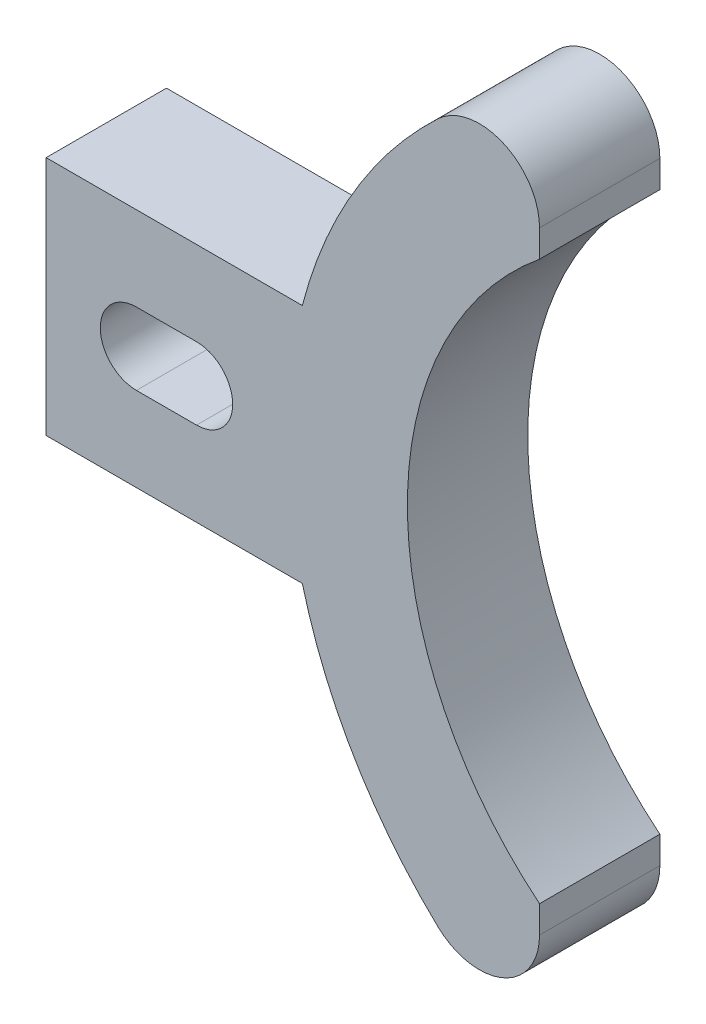
ISO-10303-21;
HEADER;
FILE_DESCRIPTION(('STEP AP214'),'2;1');
FILE_NAME('part.step','',(''),(''),'','','');
FILE_SCHEMA(('AUTOMOTIVE_DESIGN { 1 0 10303 214 1 1 1 1 }'));
ENDSEC;
DATA;
#1=APPLICATION_CONTEXT('core data for automotive mechanical design processes');
#2=APPLICATION_PROTOCOL_DEFINITION('international standard','automotive_design',2000,#1);
#3=PRODUCT_CONTEXT('',#1,'mechanical');
#4=PRODUCT('Part','Part','',(#3));
#5=PRODUCT_RELATED_PRODUCT_CATEGORY('part','',(#4));
#6=PRODUCT_DEFINITION_FORMATION('','',#4);
#7=PRODUCT_DEFINITION_CONTEXT('part definition',#1,'design');
#8=PRODUCT_DEFINITION('design','',#6,#7);
#9=PRODUCT_DEFINITION_SHAPE('','',#8);
#10=(LENGTH_UNIT() NAMED_UNIT(*) SI_UNIT(.MILLI.,.METRE.));
#11=(NAMED_UNIT(*) PLANE_ANGLE_UNIT() SI_UNIT($,.RADIAN.));
#12=(NAMED_UNIT(*) SI_UNIT($,.STERADIAN.) SOLID_ANGLE_UNIT());
#13=UNCERTAINTY_MEASURE_WITH_UNIT(LENGTH_MEASURE(1.E-05),#10,'distance_accuracy_value','');
#14=(GEOMETRIC_REPRESENTATION_CONTEXT(3) GLOBAL_UNCERTAINTY_ASSIGNED_CONTEXT((#13)) GLOBAL_UNIT_ASSIGNED_CONTEXT((#10,
#11,#12)) REPRESENTATION_CONTEXT('',''));
#15=CARTESIAN_POINT('',(0.,0.,0.));
#16=DIRECTION('',(0.,0.,1.));
#17=DIRECTION('',(1.,0.,0.));
#18=AXIS2_PLACEMENT_3D('',#15,#16,#17);
#19=CARTESIAN_POINT('',(0.,0.,12.7));
#20=DIRECTION('',(0.,1.,0.));
#21=DIRECTION('',(0.,0.,1.));
#22=AXIS2_PLACEMENT_3D('',#19,#20,#21);
#23=PLANE('',#22);
#24=DIRECTION('',(1.,0.,0.));
#25=VECTOR('',#24,1.);
#26=CARTESIAN_POINT('',(0.,0.,0.));
#27=LINE('',#26,#25);
#28=CARTESIAN_POINT('',(0.,0.,0.));
#29=VERTEX_POINT('',#28);
#30=CARTESIAN_POINT('',(27.0389318159176,0.,0.));
#31=VERTEX_POINT('',#30);
#32=EDGE_CURVE('E225',#29,#31,#27,.T.);
#33=ORIENTED_EDGE('',*,*,#32,.T.);
#34=DIRECTION('',(0.,0.,-1.));
#35=VECTOR('',#34,1.);
#36=CARTESIAN_POINT('',(27.0389318159176,0.,12.7));
#37=LINE('',#36,#35);
#38=CARTESIAN_POINT('',(27.0389318159176,0.,12.7));
#39=VERTEX_POINT('',#38);
#40=EDGE_CURVE('E256',#39,#31,#37,.T.);
#41=ORIENTED_EDGE('',*,*,#40,.F.);
#42=DIRECTION('',(1.,0.,0.));
#43=VECTOR('',#42,1.);
#44=CARTESIAN_POINT('',(0.,0.,12.7));
#45=LINE('',#44,#43);
#46=CARTESIAN_POINT('',(0.,0.,12.7));
#47=VERTEX_POINT('',#46);
#48=EDGE_CURVE('E201',#47,#39,#45,.T.);
#49=ORIENTED_EDGE('',*,*,#48,.F.);
#50=DIRECTION('',(0.,0.,-1.));
#51=VECTOR('',#50,1.);
#52=CARTESIAN_POINT('',(0.,0.,12.7));
#53=LINE('',#52,#51);
#54=EDGE_CURVE('E224',#47,#29,#53,.T.);
#55=ORIENTED_EDGE('',*,*,#54,.T.);
#56=EDGE_LOOP('',(#33,#41,#49,#55));
#57=FACE_BOUND('',#56,.T.);
#58=ADVANCED_FACE('F40',(#57),#23,.F.);
#59=CARTESIAN_POINT('',(76.2,12.7,12.7));
#60=DIRECTION('',(0.,0.,-1.));
#61=DIRECTION('',(-1.,0.,0.));
#62=AXIS2_PLACEMENT_3D('',#59,#60,#61);
#63=CYLINDRICAL_SURFACE('',#62,50.775);
#64=CARTESIAN_POINT('',(76.2,12.7,0.));
#65=DIRECTION('',(0.,0.,1.));
#66=DIRECTION('',(1.,0.,0.));
#67=AXIS2_PLACEMENT_3D('',#64,#65,#66);
#68=CIRCLE('',#67,50.775);
#69=CARTESIAN_POINT('',(41.3632639279685,-24.2391722274284,0.));
#70=VERTEX_POINT('',#69);
#71=EDGE_CURVE('E229',#31,#70,#68,.T.);
#72=ORIENTED_EDGE('',*,*,#71,.T.);
#73=DIRECTION('',(0.,0.,-1.));
#74=VECTOR('',#73,1.);
#75=CARTESIAN_POINT('',(41.3632639279685,-24.2391722274284,12.7));
#76=LINE('',#75,#74);
#77=CARTESIAN_POINT('',(41.3632639279685,-24.2391722274284,12.7));
#78=VERTEX_POINT('',#77);
#79=EDGE_CURVE('E283',#70,#78,#76,.F.);
#80=ORIENTED_EDGE('',*,*,#79,.T.);
#81=CARTESIAN_POINT('',(76.2,12.7,12.7));
#82=DIRECTION('',(0.,0.,1.));
#83=DIRECTION('',(1.,0.,0.));
#84=AXIS2_PLACEMENT_3D('',#81,#82,#83);
#85=CIRCLE('',#84,50.775);
#86=EDGE_CURVE('E205',#39,#78,#85,.T.);
#87=ORIENTED_EDGE('',*,*,#86,.F.);
#88=ORIENTED_EDGE('',*,*,#40,.T.);
#89=EDGE_LOOP('',(#72,#80,#87,#88));
#90=FACE_BOUND('',#89,.T.);
#91=ADVANCED_FACE('F299',(#90),#63,.T.);
#92=CARTESIAN_POINT('',(76.2,12.7,12.7));
#93=DIRECTION('',(0.,0.,-1.));
#94=DIRECTION('',(-1.,0.,0.));
#95=AXIS2_PLACEMENT_3D('',#92,#93,#94);
#96=CYLINDRICAL_SURFACE('',#95,38.075);
#97=DIRECTION('',(0.,0.,-1.));
#98=VECTOR('',#97,1.);
#99=CARTESIAN_POINT('',(52.07,42.152482492992,12.7));
#100=LINE('',#99,#98);
#101=CARTESIAN_POINT('',(52.07,42.152482492992,12.7));
#102=VERTEX_POINT('',#101);
#103=CARTESIAN_POINT('',(52.07,42.152482492992,0.));
#104=VERTEX_POINT('',#103);
#105=EDGE_CURVE('E196',#102,#104,#100,.T.);
#106=ORIENTED_EDGE('',*,*,#105,.F.);
#107=CARTESIAN_POINT('',(76.2,12.7,12.7));
#108=DIRECTION('',(0.,0.,1.));
#109=DIRECTION('',(1.,0.,0.));
#110=AXIS2_PLACEMENT_3D('',#107,#108,#109);
#111=CIRCLE('',#110,38.075);
#112=CARTESIAN_POINT('',(52.07,-16.752482492992,12.7));
#113=VERTEX_POINT('',#112);
#114=EDGE_CURVE('E209',#102,#113,#111,.T.);
#115=ORIENTED_EDGE('',*,*,#114,.T.);
#116=DIRECTION('',(0.,0.,-1.));
#117=VECTOR('',#116,1.);
#118=CARTESIAN_POINT('',(52.07,-16.752482492992,12.7));
#119=LINE('',#118,#117);
#120=CARTESIAN_POINT('',(52.07,-16.752482492992,0.));
#121=VERTEX_POINT('',#120);
#122=EDGE_CURVE('E184',#121,#113,#119,.F.);
#123=ORIENTED_EDGE('',*,*,#122,.F.);
#124=CARTESIAN_POINT('',(76.2,12.7,0.));
#125=DIRECTION('',(0.,0.,1.));
#126=DIRECTION('',(1.,0.,0.));
#127=AXIS2_PLACEMENT_3D('',#124,#125,#126);
#128=CIRCLE('',#127,38.075);
#129=EDGE_CURVE('E233',#104,#121,#128,.T.);
#130=ORIENTED_EDGE('',*,*,#129,.F.);
#131=EDGE_LOOP('',(#106,#115,#123,#130));
#132=FACE_BOUND('',#131,.T.);
#133=ADVANCED_FACE('F331',(#132),#96,.F.);
#134=CARTESIAN_POINT('',(76.2,12.7,12.7));
#135=DIRECTION('',(0.,0.,-1.));
#136=DIRECTION('',(-1.,0.,0.));
#137=AXIS2_PLACEMENT_3D('',#134,#135,#136);
#138=CYLINDRICAL_SURFACE('',#137,50.775);
#139=CARTESIAN_POINT('',(76.2,12.7,12.7));
#140=DIRECTION('',(0.,0.,1.));
#141=DIRECTION('',(1.,0.,0.));
#142=AXIS2_PLACEMENT_3D('',#139,#140,#141);
#143=CIRCLE('',#142,50.775);
#144=CARTESIAN_POINT('',(41.3632639279685,49.6391722274284,12.7));
#145=VERTEX_POINT('',#144);
#146=CARTESIAN_POINT('',(27.0389318159176,25.4,12.7));
#147=VERTEX_POINT('',#146);
#148=EDGE_CURVE('E213',#145,#147,#143,.T.);
#149=ORIENTED_EDGE('',*,*,#148,.F.);
#150=DIRECTION('',(0.,0.,-1.));
#151=VECTOR('',#150,1.);
#152=CARTESIAN_POINT('',(41.3632639279685,49.6391722274284,12.7));
#153=LINE('',#152,#151);
#154=CARTESIAN_POINT('',(41.3632639279685,49.6391722274284,0.));
#155=VERTEX_POINT('',#154);
#156=EDGE_CURVE('E265',#145,#155,#153,.T.);
#157=ORIENTED_EDGE('',*,*,#156,.T.);
#158=CARTESIAN_POINT('',(76.2,12.7,0.));
#159=DIRECTION('',(0.,0.,1.));
#160=DIRECTION('',(1.,0.,0.));
#161=AXIS2_PLACEMENT_3D('',#158,#159,#160);
#162=CIRCLE('',#161,50.775);
#163=CARTESIAN_POINT('',(27.0389318159176,25.4,0.));
#164=VERTEX_POINT('',#163);
#165=EDGE_CURVE('E237',#155,#164,#162,.T.);
#166=ORIENTED_EDGE('',*,*,#165,.T.);
#167=DIRECTION('',(0.,0.,-1.));
#168=VECTOR('',#167,1.);
#169=CARTESIAN_POINT('',(27.0389318159176,25.4,12.7));
#170=LINE('',#169,#168);
#171=EDGE_CURVE('E252',#147,#164,#170,.T.);
#172=ORIENTED_EDGE('',*,*,#171,.F.);
#173=EDGE_LOOP('',(#149,#157,#166,#172));
#174=FACE_BOUND('',#173,.T.);
#175=ADVANCED_FACE('F318',(#174),#138,.T.);
#176=CARTESIAN_POINT('',(0.,25.4,12.7));
#177=DIRECTION('',(0.,1.,0.));
#178=DIRECTION('',(0.,0.,1.));
#179=AXIS2_PLACEMENT_3D('',#176,#177,#178);
#180=PLANE('',#179);
#181=DIRECTION('',(1.,0.,0.));
#182=VECTOR('',#181,1.);
#183=CARTESIAN_POINT('',(0.,25.4,0.));
#184=LINE('',#183,#182);
#185=CARTESIAN_POINT('',(0.,25.4,0.));
#186=VERTEX_POINT('',#185);
#187=EDGE_CURVE('E240',#186,#164,#184,.T.);
#188=ORIENTED_EDGE('',*,*,#187,.F.);
#189=DIRECTION('',(0.,0.,-1.));
#190=VECTOR('',#189,1.);
#191=CARTESIAN_POINT('',(0.,25.4,12.7));
#192=LINE('',#191,#190);
#193=CARTESIAN_POINT('',(0.,25.4,12.7));
#194=VERTEX_POINT('',#193);
#195=EDGE_CURVE('E249',#194,#186,#192,.T.);
#196=ORIENTED_EDGE('',*,*,#195,.F.);
#197=DIRECTION('',(1.,0.,0.));
#198=VECTOR('',#197,1.);
#199=CARTESIAN_POINT('',(0.,25.4,12.7));
#200=LINE('',#199,#198);
#201=EDGE_CURVE('E216',#194,#147,#200,.T.);
#202=ORIENTED_EDGE('',*,*,#201,.T.);
#203=ORIENTED_EDGE('',*,*,#171,.T.);
#204=EDGE_LOOP('',(#188,#196,#202,#203));
#205=FACE_BOUND('',#204,.T.);
#206=ADVANCED_FACE('F313',(#205),#180,.T.);
#207=CARTESIAN_POINT('',(0.,0.,12.7));
#208=DIRECTION('',(-1.,0.,0.));
#209=DIRECTION('',(0.,0.,1.));
#210=AXIS2_PLACEMENT_3D('',#207,#208,#209);
#211=PLANE('',#210);
#212=DIRECTION('',(0.,1.,0.));
#213=VECTOR('',#212,1.);
#214=CARTESIAN_POINT('',(0.,0.,0.));
#215=LINE('',#214,#213);
#216=EDGE_CURVE('E206',#29,#186,#215,.T.);
#217=ORIENTED_EDGE('',*,*,#216,.F.);
#218=ORIENTED_EDGE('',*,*,#54,.F.);
#219=DIRECTION('',(0.,1.,0.));
#220=VECTOR('',#219,1.);
#221=CARTESIAN_POINT('',(0.,0.,12.7));
#222=LINE('',#221,#220);
#223=EDGE_CURVE('E220',#47,#194,#222,.T.);
#224=ORIENTED_EDGE('',*,*,#223,.T.);
#225=ORIENTED_EDGE('',*,*,#195,.T.);
#226=EDGE_LOOP('',(#217,#218,#224,#225));
#227=FACE_BOUND('',#226,.T.);
#228=ADVANCED_FACE('F310',(#227),#211,.T.);
#229=CARTESIAN_POINT('',(0.,0.,12.7));
#230=DIRECTION('',(0.,0.,1.));
#231=DIRECTION('',(1.,0.,0.));
#232=AXIS2_PLACEMENT_3D('',#229,#230,#231);
#233=PLANE('',#232);
#234=DIRECTION('',(-1.,0.,0.));
#235=VECTOR('',#234,1.);
#236=CARTESIAN_POINT('',(9.525,16.51,12.7));
#237=LINE('',#236,#235);
#238=CARTESIAN_POINT('',(15.875,16.51,12.7));
#239=VERTEX_POINT('',#238);
#240=CARTESIAN_POINT('',(9.525,16.51,12.7));
#241=VERTEX_POINT('',#240);
#242=EDGE_CURVE('E165',#239,#241,#237,.T.);
#243=ORIENTED_EDGE('',*,*,#242,.F.);
#244=CARTESIAN_POINT('',(15.875,12.7,12.7));
#245=DIRECTION('',(0.,0.,1.));
#246=DIRECTION('',(1.,0.,0.));
#247=AXIS2_PLACEMENT_3D('',#244,#245,#246);
#248=CIRCLE('',#247,3.81);
#249=CARTESIAN_POINT('',(15.875,8.89,12.7));
#250=VERTEX_POINT('',#249);
#251=EDGE_CURVE('E170',#250,#239,#248,.T.);
#252=ORIENTED_EDGE('',*,*,#251,.F.);
#253=DIRECTION('',(1.,0.,0.));
#254=VECTOR('',#253,1.);
#255=CARTESIAN_POINT('',(9.525,8.89,12.7));
#256=LINE('',#255,#254);
#257=CARTESIAN_POINT('',(9.525,8.89,12.7));
#258=VERTEX_POINT('',#257);
#259=EDGE_CURVE('E175',#258,#250,#256,.T.);
#260=ORIENTED_EDGE('',*,*,#259,.F.);
#261=CARTESIAN_POINT('',(9.525,12.7,12.7));
#262=DIRECTION('',(0.,0.,1.));
#263=DIRECTION('',(1.,0.,0.));
#264=AXIS2_PLACEMENT_3D('',#261,#262,#263);
#265=CIRCLE('',#264,3.81);
#266=EDGE_CURVE('E159',#241,#258,#265,.T.);
#267=ORIENTED_EDGE('',*,*,#266,.F.);
#268=EDGE_LOOP('',(#243,#252,#260,#267));
#269=FACE_BOUND('',#268,.T.);
#270=DIRECTION('',(0.,-1.,0.));
#271=VECTOR('',#270,1.);
#272=CARTESIAN_POINT('',(52.07,0.,12.7));
#273=LINE('',#272,#271);
#274=CARTESIAN_POINT('',(52.07,45.0195022393601,12.7));
#275=VERTEX_POINT('',#274);
#276=EDGE_CURVE('E197',#275,#102,#273,.T.);
#277=ORIENTED_EDGE('',*,*,#276,.F.);
#278=CARTESIAN_POINT('',(45.72,45.0195022393601,12.7));
#279=DIRECTION('',(0.,0.,1.));
#280=DIRECTION('',(1.,0.,0.));
#281=AXIS2_PLACEMENT_3D('',#278,#279,#280);
#282=CIRCLE('',#281,6.35);
#283=EDGE_CURVE('E280',#275,#145,#282,.T.);
#284=ORIENTED_EDGE('',*,*,#283,.T.);
#285=ORIENTED_EDGE('',*,*,#148,.T.);
#286=ORIENTED_EDGE('',*,*,#201,.F.);
#287=ORIENTED_EDGE('',*,*,#223,.F.);
#288=ORIENTED_EDGE('',*,*,#48,.T.);
#289=ORIENTED_EDGE('',*,*,#86,.T.);
#290=CARTESIAN_POINT('',(45.72,-19.6195022393601,12.7));
#291=DIRECTION('',(0.,0.,1.));
#292=DIRECTION('',(1.,0.,0.));
#293=AXIS2_PLACEMENT_3D('',#290,#291,#292);
#294=CIRCLE('',#293,6.35);
#295=CARTESIAN_POINT('',(52.07,-19.6195022393601,12.7));
#296=VERTEX_POINT('',#295);
#297=EDGE_CURVE('E64',#78,#296,#294,.T.);
#298=ORIENTED_EDGE('',*,*,#297,.T.);
#299=EDGE_CURVE('E193',#113,#296,#273,.T.);
#300=ORIENTED_EDGE('',*,*,#299,.F.);
#301=ORIENTED_EDGE('',*,*,#114,.F.);
#302=EDGE_LOOP('',(#277,#284,#285,#286,#287,#288,#289,#298,#300,#301));
#303=FACE_BOUND('',#302,.T.);
#304=ADVANCED_FACE('F301',(#269,#303),#233,.T.);
#305=CARTESIAN_POINT('',(0.,0.,0.));
#306=DIRECTION('',(0.,0.,1.));
#307=DIRECTION('',(1.,0.,0.));
#308=AXIS2_PLACEMENT_3D('',#305,#306,#307);
#309=PLANE('',#308);
#310=ORIENTED_EDGE('',*,*,#165,.F.);
#311=CARTESIAN_POINT('',(45.72,45.0195022393601,0.));
#312=DIRECTION('',(0.,0.,1.));
#313=DIRECTION('',(1.,0.,0.));
#314=AXIS2_PLACEMENT_3D('',#311,#312,#313);
#315=CIRCLE('',#314,6.35);
#316=CARTESIAN_POINT('',(52.07,45.0195022393601,0.));
#317=VERTEX_POINT('',#316);
#318=EDGE_CURVE('E272',#155,#317,#315,.F.);
#319=ORIENTED_EDGE('',*,*,#318,.T.);
#320=DIRECTION('',(0.,-1.,0.));
#321=VECTOR('',#320,1.);
#322=CARTESIAN_POINT('',(52.07,0.,0.));
#323=LINE('',#322,#321);
#324=EDGE_CURVE('E264',#317,#104,#323,.T.);
#325=ORIENTED_EDGE('',*,*,#324,.T.);
#326=ORIENTED_EDGE('',*,*,#129,.T.);
#327=CARTESIAN_POINT('',(52.07,-19.6195022393601,0.));
#328=VERTEX_POINT('',#327);
#329=EDGE_CURVE('E260',#121,#328,#323,.T.);
#330=ORIENTED_EDGE('',*,*,#329,.T.);
#331=CARTESIAN_POINT('',(45.72,-19.6195022393601,0.));
#332=DIRECTION('',(0.,0.,1.));
#333=DIRECTION('',(1.,0.,0.));
#334=AXIS2_PLACEMENT_3D('',#331,#332,#333);
#335=CIRCLE('',#334,6.35);
#336=EDGE_CURVE('E269',#328,#70,#335,.F.);
#337=ORIENTED_EDGE('',*,*,#336,.T.);
#338=ORIENTED_EDGE('',*,*,#71,.F.);
#339=ORIENTED_EDGE('',*,*,#32,.F.);
#340=ORIENTED_EDGE('',*,*,#216,.T.);
#341=ORIENTED_EDGE('',*,*,#187,.T.);
#342=EDGE_LOOP('',(#310,#319,#325,#326,#330,#337,#338,#339,#340,#341));
#343=FACE_BOUND('',#342,.T.);
#344=CARTESIAN_POINT('',(15.875,12.7,0.));
#345=DIRECTION('',(0.,0.,1.));
#346=DIRECTION('',(1.,0.,0.));
#347=AXIS2_PLACEMENT_3D('',#344,#345,#346);
#348=CIRCLE('',#347,3.81);
#349=CARTESIAN_POINT('',(15.875,8.89,0.));
#350=VERTEX_POINT('',#349);
#351=CARTESIAN_POINT('',(15.875,16.51,0.));
#352=VERTEX_POINT('',#351);
#353=EDGE_CURVE('E56',#350,#352,#348,.T.);
#354=ORIENTED_EDGE('',*,*,#353,.T.);
#355=DIRECTION('',(-1.,0.,0.));
#356=VECTOR('',#355,1.);
#357=CARTESIAN_POINT('',(0.,16.51,0.));
#358=LINE('',#357,#356);
#359=CARTESIAN_POINT('',(9.525,16.51,0.));
#360=VERTEX_POINT('',#359);
#361=EDGE_CURVE('E11',#352,#360,#358,.T.);
#362=ORIENTED_EDGE('',*,*,#361,.T.);
#363=CARTESIAN_POINT('',(9.525,12.7,0.));
#364=DIRECTION('',(0.,0.,1.));
#365=DIRECTION('',(1.,0.,0.));
#366=AXIS2_PLACEMENT_3D('',#363,#364,#365);
#367=CIRCLE('',#366,3.81);
#368=CARTESIAN_POINT('',(9.525,8.89,0.));
#369=VERTEX_POINT('',#368);
#370=EDGE_CURVE('E157',#360,#369,#367,.T.);
#371=ORIENTED_EDGE('',*,*,#370,.T.);
#372=DIRECTION('',(1.,0.,0.));
#373=VECTOR('',#372,1.);
#374=CARTESIAN_POINT('',(0.,8.89,0.));
#375=LINE('',#374,#373);
#376=EDGE_CURVE('E49',#369,#350,#375,.T.);
#377=ORIENTED_EDGE('',*,*,#376,.T.);
#378=EDGE_LOOP('',(#354,#362,#371,#377));
#379=FACE_BOUND('',#378,.T.);
#380=ADVANCED_FACE('F163',(#343,#379),#309,.F.);
#381=CARTESIAN_POINT('',(52.07,0.,0.));
#382=DIRECTION('',(-1.,0.,0.));
#383=DIRECTION('',(0.,0.,1.));
#384=AXIS2_PLACEMENT_3D('',#381,#382,#383);
#385=PLANE('',#384);
#386=ORIENTED_EDGE('',*,*,#299,.T.);
#387=DIRECTION('',(0.,0.,-1.));
#388=VECTOR('',#387,1.);
#389=CARTESIAN_POINT('',(52.07,-19.6195022393601,0.));
#390=LINE('',#389,#388);
#391=EDGE_CURVE('E152',#296,#328,#390,.T.);
#392=ORIENTED_EDGE('',*,*,#391,.T.);
#393=ORIENTED_EDGE('',*,*,#329,.F.);
#394=ORIENTED_EDGE('',*,*,#122,.T.);
#395=EDGE_LOOP('',(#386,#392,#393,#394));
#396=FACE_BOUND('',#395,.T.);
#397=ADVANCED_FACE('F290',(#396),#385,.F.);
#398=ORIENTED_EDGE('',*,*,#324,.F.);
#399=DIRECTION('',(0.,0.,-1.));
#400=VECTOR('',#399,1.);
#401=CARTESIAN_POINT('',(52.07,45.0195022393601,0.));
#402=LINE('',#401,#400);
#403=EDGE_CURVE('E275',#317,#275,#402,.F.);
#404=ORIENTED_EDGE('',*,*,#403,.T.);
#405=ORIENTED_EDGE('',*,*,#276,.T.);
#406=ORIENTED_EDGE('',*,*,#105,.T.);
#407=EDGE_LOOP('',(#398,#404,#405,#406));
#408=FACE_BOUND('',#407,.T.);
#409=ADVANCED_FACE('F325',(#408),#385,.F.);
#410=CARTESIAN_POINT('',(45.72,45.0195022393601,12.7));
#411=DIRECTION('',(0.,0.,-1.));
#412=DIRECTION('',(-1.,0.,0.));
#413=AXIS2_PLACEMENT_3D('',#410,#411,#412);
#414=CYLINDRICAL_SURFACE('',#413,6.35);
#415=ORIENTED_EDGE('',*,*,#283,.F.);
#416=ORIENTED_EDGE('',*,*,#403,.F.);
#417=ORIENTED_EDGE('',*,*,#318,.F.);
#418=ORIENTED_EDGE('',*,*,#156,.F.);
#419=EDGE_LOOP('',(#415,#416,#417,#418));
#420=FACE_BOUND('',#419,.T.);
#421=ADVANCED_FACE('F322',(#420),#414,.T.);
#422=CARTESIAN_POINT('',(45.72,-19.6195022393601,12.7));
#423=DIRECTION('',(0.,0.,-1.));
#424=DIRECTION('',(-1.,0.,0.));
#425=AXIS2_PLACEMENT_3D('',#422,#423,#424);
#426=CYLINDRICAL_SURFACE('',#425,6.35);
#427=ORIENTED_EDGE('',*,*,#336,.F.);
#428=ORIENTED_EDGE('',*,*,#391,.F.);
#429=ORIENTED_EDGE('',*,*,#297,.F.);
#430=ORIENTED_EDGE('',*,*,#79,.F.);
#431=EDGE_LOOP('',(#427,#428,#429,#430));
#432=FACE_BOUND('',#431,.T.);
#433=ADVANCED_FACE('F42',(#432),#426,.T.);
#434=CARTESIAN_POINT('',(9.525,16.51,0.));
#435=DIRECTION('',(0.,1.,0.));
#436=DIRECTION('',(0.,0.,1.));
#437=AXIS2_PLACEMENT_3D('',#434,#435,#436);
#438=PLANE('',#437);
#439=ORIENTED_EDGE('',*,*,#242,.T.);
#440=DIRECTION('',(0.,0.,1.));
#441=VECTOR('',#440,1.);
#442=CARTESIAN_POINT('',(9.525,16.51,0.));
#443=LINE('',#442,#441);
#444=EDGE_CURVE('E181',#360,#241,#443,.T.);
#445=ORIENTED_EDGE('',*,*,#444,.F.);
#446=ORIENTED_EDGE('',*,*,#361,.F.);
#447=DIRECTION('',(0.,0.,1.));
#448=VECTOR('',#447,1.);
#449=CARTESIAN_POINT('',(15.875,16.51,0.));
#450=LINE('',#449,#448);
#451=EDGE_CURVE('E185',#352,#239,#450,.T.);
#452=ORIENTED_EDGE('',*,*,#451,.T.);
#453=EDGE_LOOP('',(#439,#445,#446,#452));
#454=FACE_BOUND('',#453,.T.);
#455=ADVANCED_FACE('F351',(#454),#438,.F.);
#456=CARTESIAN_POINT('',(9.525,8.89,0.));
#457=DIRECTION('',(0.,-1.,0.));
#458=DIRECTION('',(1.,0.,0.));
#459=AXIS2_PLACEMENT_3D('',#456,#457,#458);
#460=PLANE('',#459);
#461=ORIENTED_EDGE('',*,*,#259,.T.);
#462=DIRECTION('',(0.,0.,1.));
#463=VECTOR('',#462,1.);
#464=CARTESIAN_POINT('',(15.875,8.89,0.));
#465=LINE('',#464,#463);
#466=EDGE_CURVE('E148',#350,#250,#465,.T.);
#467=ORIENTED_EDGE('',*,*,#466,.F.);
#468=ORIENTED_EDGE('',*,*,#376,.F.);
#469=DIRECTION('',(0.,0.,1.));
#470=VECTOR('',#469,1.);
#471=CARTESIAN_POINT('',(9.525,8.89,0.));
#472=LINE('',#471,#470);
#473=EDGE_CURVE('E146',#369,#258,#472,.T.);
#474=ORIENTED_EDGE('',*,*,#473,.T.);
#475=EDGE_LOOP('',(#461,#467,#468,#474));
#476=FACE_BOUND('',#475,.T.);
#477=ADVANCED_FACE('F145',(#476),#460,.F.);
#478=CARTESIAN_POINT('',(9.525,12.7,0.));
#479=DIRECTION('',(0.,0.,1.));
#480=DIRECTION('',(1.,0.,0.));
#481=AXIS2_PLACEMENT_3D('',#478,#479,#480);
#482=CYLINDRICAL_SURFACE('',#481,3.81);
#483=ORIENTED_EDGE('',*,*,#266,.T.);
#484=ORIENTED_EDGE('',*,*,#473,.F.);
#485=ORIENTED_EDGE('',*,*,#370,.F.);
#486=ORIENTED_EDGE('',*,*,#444,.T.);
#487=EDGE_LOOP('',(#483,#484,#485,#486));
#488=FACE_BOUND('',#487,.T.);
#489=ADVANCED_FACE('F155',(#488),#482,.F.);
#490=CARTESIAN_POINT('',(15.875,12.7,0.));
#491=DIRECTION('',(0.,0.,1.));
#492=DIRECTION('',(1.,0.,0.));
#493=AXIS2_PLACEMENT_3D('',#490,#491,#492);
#494=CYLINDRICAL_SURFACE('',#493,3.81);
#495=ORIENTED_EDGE('',*,*,#251,.T.);
#496=ORIENTED_EDGE('',*,*,#451,.F.);
#497=ORIENTED_EDGE('',*,*,#353,.F.);
#498=ORIENTED_EDGE('',*,*,#466,.T.);
#499=EDGE_LOOP('',(#495,#496,#497,#498));
#500=FACE_BOUND('',#499,.T.);
#501=ADVANCED_FACE('F429',(#500),#494,.F.);
#502=CLOSED_SHELL('',(#58,#91,#133,#175,#206,#228,#304,#380,#397,#409,#421,#433,#455,#477,#489,#501));
#503=MANIFOLD_SOLID_BREP('B2',#502);
#504=ADVANCED_BREP_SHAPE_REPRESENTATION('',(#18,#503),#14);
#505=SHAPE_DEFINITION_REPRESENTATION(#9,#504);
ENDSEC;
END-ISO-10303-21;
